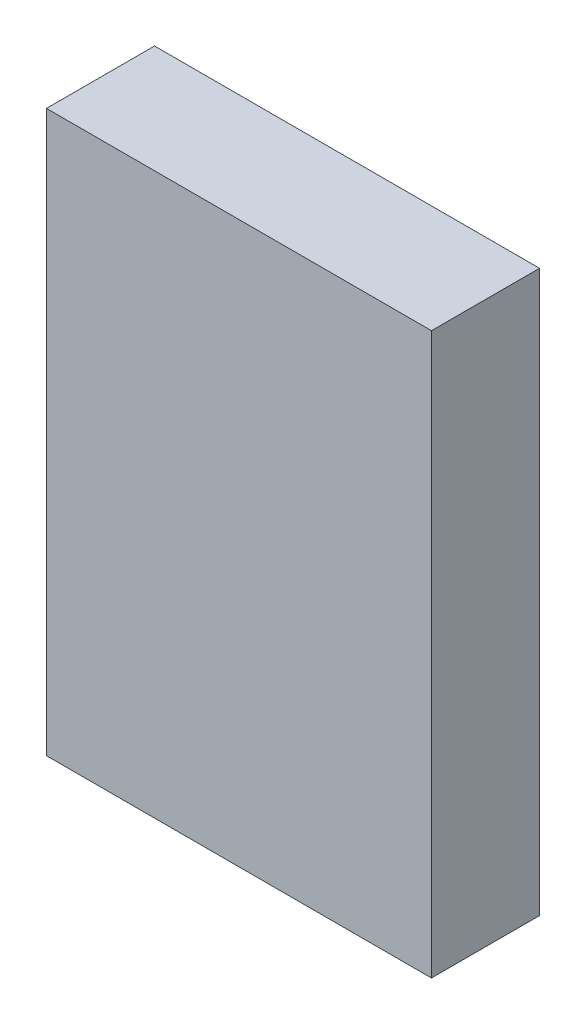
ISO-10303-21;
HEADER;
FILE_DESCRIPTION(('STEP AP214'),'2;1');
FILE_NAME('part.step','',(''),(''),'','','');
FILE_SCHEMA(('AUTOMOTIVE_DESIGN { 1 0 10303 214 1 1 1 1 }'));
ENDSEC;
DATA;
#1=APPLICATION_CONTEXT('core data for automotive mechanical design processes');
#2=APPLICATION_PROTOCOL_DEFINITION('international standard','automotive_design',2000,#1);
#3=PRODUCT_CONTEXT('',#1,'mechanical');
#4=PRODUCT('Part','Part','',(#3));
#5=PRODUCT_RELATED_PRODUCT_CATEGORY('part','',(#4));
#6=PRODUCT_DEFINITION_FORMATION('','',#4);
#7=PRODUCT_DEFINITION_CONTEXT('part definition',#1,'design');
#8=PRODUCT_DEFINITION('design','',#6,#7);
#9=PRODUCT_DEFINITION_SHAPE('','',#8);
#10=(LENGTH_UNIT() NAMED_UNIT(*) SI_UNIT(.MILLI.,.METRE.));
#11=(NAMED_UNIT(*) PLANE_ANGLE_UNIT() SI_UNIT($,.RADIAN.));
#12=(NAMED_UNIT(*) SI_UNIT($,.STERADIAN.) SOLID_ANGLE_UNIT());
#13=UNCERTAINTY_MEASURE_WITH_UNIT(LENGTH_MEASURE(1.E-05),#10,'distance_accuracy_value','');
#14=(GEOMETRIC_REPRESENTATION_CONTEXT(3) GLOBAL_UNCERTAINTY_ASSIGNED_CONTEXT((#13)) GLOBAL_UNIT_ASSIGNED_CONTEXT((#10,
#11,#12)) REPRESENTATION_CONTEXT('',''));
#15=CARTESIAN_POINT('',(0.,0.,0.));
#16=DIRECTION('',(0.,0.,1.));
#17=DIRECTION('',(1.,0.,0.));
#18=AXIS2_PLACEMENT_3D('',#15,#16,#17);
#19=CARTESIAN_POINT('',(0.,0.,16.));
#20=DIRECTION('',(0.,1.,0.));
#21=DIRECTION('',(0.,0.,1.));
#22=AXIS2_PLACEMENT_3D('',#19,#20,#21);
#23=PLANE('',#22);
#24=DIRECTION('',(1.,0.,0.));
#25=VECTOR('',#24,1.);
#26=CARTESIAN_POINT('',(0.,0.,0.));
#27=LINE('',#26,#25);
#28=CARTESIAN_POINT('',(-57.,0.,0.));
#29=VERTEX_POINT('',#28);
#30=CARTESIAN_POINT('',(0.,0.,0.));
#31=VERTEX_POINT('',#30);
#32=EDGE_CURVE('E104',#29,#31,#27,.T.);
#33=ORIENTED_EDGE('',*,*,#32,.T.);
#34=DIRECTION('',(0.,0.,-1.));
#35=VECTOR('',#34,1.);
#36=CARTESIAN_POINT('',(0.,0.,16.));
#37=LINE('',#36,#35);
#38=CARTESIAN_POINT('',(0.,0.,16.));
#39=VERTEX_POINT('',#38);
#40=EDGE_CURVE('E11',#39,#31,#37,.T.);
#41=ORIENTED_EDGE('',*,*,#40,.F.);
#42=DIRECTION('',(1.,0.,0.));
#43=VECTOR('',#42,1.);
#44=CARTESIAN_POINT('',(0.,0.,16.));
#45=LINE('',#44,#43);
#46=CARTESIAN_POINT('',(-57.,0.,16.));
#47=VERTEX_POINT('',#46);
#48=EDGE_CURVE('E92',#47,#39,#45,.T.);
#49=ORIENTED_EDGE('',*,*,#48,.F.);
#50=DIRECTION('',(0.,0.,-1.));
#51=VECTOR('',#50,1.);
#52=CARTESIAN_POINT('',(-57.,0.,16.));
#53=LINE('',#52,#51);
#54=EDGE_CURVE('E100',#47,#29,#53,.T.);
#55=ORIENTED_EDGE('',*,*,#54,.T.);
#56=EDGE_LOOP('',(#33,#41,#49,#55));
#57=FACE_BOUND('',#56,.T.);
#58=ADVANCED_FACE('F41',(#57),#23,.F.);
#59=CARTESIAN_POINT('',(0.,0.,16.));
#60=DIRECTION('',(-1.,0.,0.));
#61=DIRECTION('',(0.,0.,1.));
#62=AXIS2_PLACEMENT_3D('',#59,#60,#61);
#63=PLANE('',#62);
#64=DIRECTION('',(0.,1.,0.));
#65=VECTOR('',#64,1.);
#66=CARTESIAN_POINT('',(0.,0.,0.));
#67=LINE('',#66,#65);
#68=CARTESIAN_POINT('',(0.,83.,0.));
#69=VERTEX_POINT('',#68);
#70=EDGE_CURVE('E96',#31,#69,#67,.T.);
#71=ORIENTED_EDGE('',*,*,#70,.T.);
#72=DIRECTION('',(0.,0.,-1.));
#73=VECTOR('',#72,1.);
#74=CARTESIAN_POINT('',(0.,83.,16.));
#75=LINE('',#74,#73);
#76=CARTESIAN_POINT('',(0.,83.,16.));
#77=VERTEX_POINT('',#76);
#78=EDGE_CURVE('E49',#77,#69,#75,.T.);
#79=ORIENTED_EDGE('',*,*,#78,.F.);
#80=DIRECTION('',(0.,1.,0.));
#81=VECTOR('',#80,1.);
#82=CARTESIAN_POINT('',(0.,0.,16.));
#83=LINE('',#82,#81);
#84=EDGE_CURVE('E87',#39,#77,#83,.T.);
#85=ORIENTED_EDGE('',*,*,#84,.F.);
#86=ORIENTED_EDGE('',*,*,#40,.T.);
#87=EDGE_LOOP('',(#71,#79,#85,#86));
#88=FACE_BOUND('',#87,.T.);
#89=ADVANCED_FACE('F95',(#88),#63,.F.);
#90=CARTESIAN_POINT('',(0.,83.,16.));
#91=DIRECTION('',(0.,-1.,0.));
#92=DIRECTION('',(0.,0.,-1.));
#93=AXIS2_PLACEMENT_3D('',#90,#91,#92);
#94=PLANE('',#93);
#95=DIRECTION('',(-1.,0.,0.));
#96=VECTOR('',#95,1.);
#97=CARTESIAN_POINT('',(0.,83.,0.));
#98=LINE('',#97,#96);
#99=CARTESIAN_POINT('',(-57.,83.,0.));
#100=VERTEX_POINT('',#99);
#101=EDGE_CURVE('E74',#69,#100,#98,.T.);
#102=ORIENTED_EDGE('',*,*,#101,.T.);
#103=DIRECTION('',(0.,0.,-1.));
#104=VECTOR('',#103,1.);
#105=CARTESIAN_POINT('',(-57.,83.,16.));
#106=LINE('',#105,#104);
#107=CARTESIAN_POINT('',(-57.,83.,16.));
#108=VERTEX_POINT('',#107);
#109=EDGE_CURVE('E97',#108,#100,#106,.T.);
#110=ORIENTED_EDGE('',*,*,#109,.F.);
#111=DIRECTION('',(-1.,0.,0.));
#112=VECTOR('',#111,1.);
#113=CARTESIAN_POINT('',(0.,83.,16.));
#114=LINE('',#113,#112);
#115=EDGE_CURVE('E90',#77,#108,#114,.T.);
#116=ORIENTED_EDGE('',*,*,#115,.F.);
#117=ORIENTED_EDGE('',*,*,#78,.T.);
#118=EDGE_LOOP('',(#102,#110,#116,#117));
#119=FACE_BOUND('',#118,.T.);
#120=ADVANCED_FACE('F98',(#119),#94,.F.);
#121=CARTESIAN_POINT('',(-57.,0.,16.));
#122=DIRECTION('',(1.,0.,0.));
#123=DIRECTION('',(0.,0.,-1.));
#124=AXIS2_PLACEMENT_3D('',#121,#122,#123);
#125=PLANE('',#124);
#126=DIRECTION('',(0.,-1.,0.));
#127=VECTOR('',#126,1.);
#128=CARTESIAN_POINT('',(-57.,0.,0.));
#129=LINE('',#128,#127);
#130=EDGE_CURVE('E80',#100,#29,#129,.T.);
#131=ORIENTED_EDGE('',*,*,#130,.T.);
#132=ORIENTED_EDGE('',*,*,#54,.F.);
#133=DIRECTION('',(0.,-1.,0.));
#134=VECTOR('',#133,1.);
#135=CARTESIAN_POINT('',(-57.,0.,16.));
#136=LINE('',#135,#134);
#137=EDGE_CURVE('E57',#108,#47,#136,.T.);
#138=ORIENTED_EDGE('',*,*,#137,.F.);
#139=ORIENTED_EDGE('',*,*,#109,.T.);
#140=EDGE_LOOP('',(#131,#132,#138,#139));
#141=FACE_BOUND('',#140,.T.);
#142=ADVANCED_FACE('F111',(#141),#125,.F.);
#143=CARTESIAN_POINT('',(0.,0.,16.));
#144=DIRECTION('',(0.,0.,-1.));
#145=DIRECTION('',(-1.,0.,0.));
#146=AXIS2_PLACEMENT_3D('',#143,#144,#145);
#147=PLANE('',#146);
#148=ORIENTED_EDGE('',*,*,#48,.T.);
#149=ORIENTED_EDGE('',*,*,#84,.T.);
#150=ORIENTED_EDGE('',*,*,#115,.T.);
#151=ORIENTED_EDGE('',*,*,#137,.T.);
#152=EDGE_LOOP('',(#148,#149,#150,#151));
#153=FACE_BOUND('',#152,.T.);
#154=ADVANCED_FACE('F88',(#153),#147,.F.);
#155=CARTESIAN_POINT('',(0.,0.,0.));
#156=DIRECTION('',(0.,0.,-1.));
#157=DIRECTION('',(-1.,0.,0.));
#158=AXIS2_PLACEMENT_3D('',#155,#156,#157);
#159=PLANE('',#158);
#160=ORIENTED_EDGE('',*,*,#32,.F.);
#161=ORIENTED_EDGE('',*,*,#130,.F.);
#162=ORIENTED_EDGE('',*,*,#101,.F.);
#163=ORIENTED_EDGE('',*,*,#70,.F.);
#164=EDGE_LOOP('',(#160,#161,#162,#163));
#165=FACE_BOUND('',#164,.T.);
#166=ADVANCED_FACE('F114',(#165),#159,.T.);
#167=CLOSED_SHELL('',(#58,#89,#120,#142,#154,#166));
#168=MANIFOLD_SOLID_BREP('B2',#167);
#169=ADVANCED_BREP_SHAPE_REPRESENTATION('',(#18,#168),#14);
#170=SHAPE_DEFINITION_REPRESENTATION(#9,#169);
ENDSEC;
END-ISO-10303-21;
